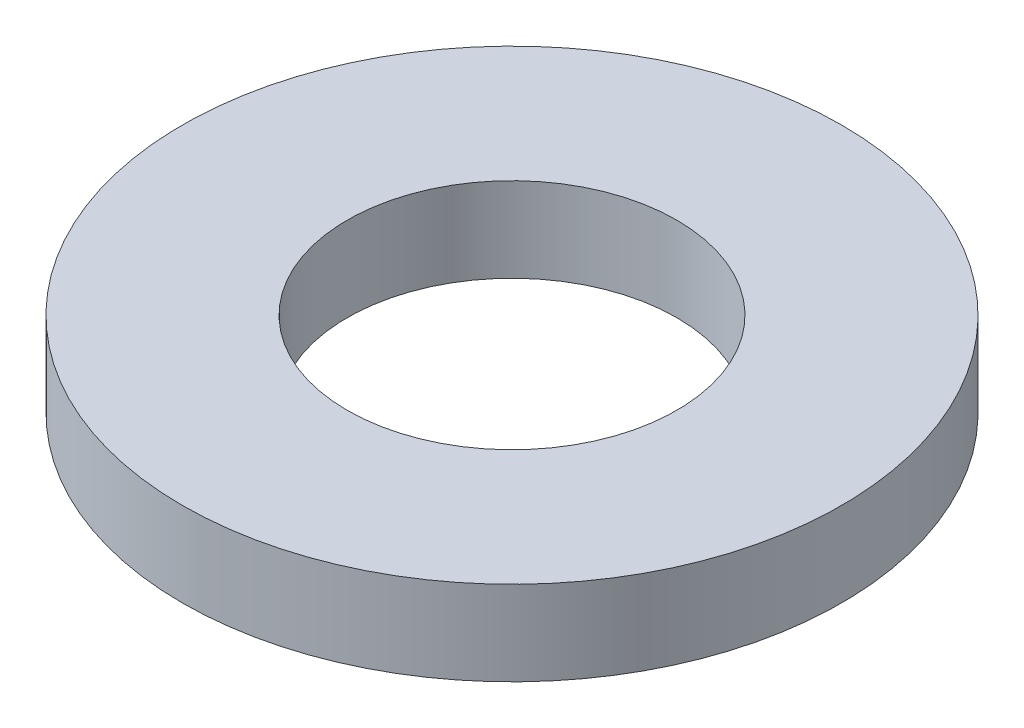
ISO-10303-21;
HEADER;
FILE_DESCRIPTION(('STEP AP214'),'2;1');
FILE_NAME('part.step','',(''),(''),'','','');
FILE_SCHEMA(('AUTOMOTIVE_DESIGN { 1 0 10303 214 1 1 1 1 }'));
ENDSEC;
DATA;
#1=APPLICATION_CONTEXT('core data for automotive mechanical design processes');
#2=APPLICATION_PROTOCOL_DEFINITION('international standard','automotive_design',2000,#1);
#3=PRODUCT_CONTEXT('',#1,'mechanical');
#4=PRODUCT('Part','Part','',(#3));
#5=PRODUCT_RELATED_PRODUCT_CATEGORY('part','',(#4));
#6=PRODUCT_DEFINITION_FORMATION('','',#4);
#7=PRODUCT_DEFINITION_CONTEXT('part definition',#1,'design');
#8=PRODUCT_DEFINITION('design','',#6,#7);
#9=PRODUCT_DEFINITION_SHAPE('','',#8);
#10=(LENGTH_UNIT() NAMED_UNIT(*) SI_UNIT(.MILLI.,.METRE.));
#11=(NAMED_UNIT(*) PLANE_ANGLE_UNIT() SI_UNIT($,.RADIAN.));
#12=(NAMED_UNIT(*) SI_UNIT($,.STERADIAN.) SOLID_ANGLE_UNIT());
#13=UNCERTAINTY_MEASURE_WITH_UNIT(LENGTH_MEASURE(1.E-05),#10,'distance_accuracy_value','');
#14=(GEOMETRIC_REPRESENTATION_CONTEXT(3) GLOBAL_UNCERTAINTY_ASSIGNED_CONTEXT((#13)) GLOBAL_UNIT_ASSIGNED_CONTEXT((#10,
#11,#12)) REPRESENTATION_CONTEXT('',''));
#15=CARTESIAN_POINT('',(0.,0.,0.));
#16=DIRECTION('',(0.,0.,1.));
#17=DIRECTION('',(1.,0.,0.));
#18=AXIS2_PLACEMENT_3D('',#15,#16,#17);
#19=CARTESIAN_POINT('',(-3.28626015289046E-11,1.01600000000968,-2.70894418008538E-11));
#20=DIRECTION('',(0.,-0.999999999999998,0.));
#21=DIRECTION('',(0.,0.,-1.00000000000013));
#22=AXIS2_PLACEMENT_3D('',#19,#20,#21);
#23=CYLINDRICAL_SURFACE('',#22,3.9624);
#24=CARTESIAN_POINT('',(-3.28626015289046E-11,1.01600000000968,-2.70894418008538E-11));
#25=DIRECTION('',(0.,0.999999999999998,0.));
#26=DIRECTION('',(0.,0.,1.00000000000013));
#27=AXIS2_PLACEMENT_3D('',#24,#25,#26);
#28=CIRCLE('',#27,3.9624);
#29=CARTESIAN_POINT('',(-3.29094524520457E-11,1.0160000000097,3.96239999997344));
#30=VERTEX_POINT('',#29);
#31=EDGE_CURVE('E10',#30,#30,#28,.T.);
#32=ORIENTED_EDGE('',*,*,#31,.F.);
#33=EDGE_LOOP('',(#32));
#34=FACE_BOUND('',#33,.T.);
#35=CARTESIAN_POINT('',(0.,0.,0.));
#36=DIRECTION('',(0.,0.999999999999998,0.));
#37=DIRECTION('',(0.,0.,1.00000000000013));
#38=AXIS2_PLACEMENT_3D('',#35,#36,#37);
#39=CIRCLE('',#38,3.9624);
#40=CARTESIAN_POINT('',(0.,0.,3.96240000000053));
#41=VERTEX_POINT('',#40);
#42=EDGE_CURVE('E37',#41,#41,#39,.T.);
#43=ORIENTED_EDGE('',*,*,#42,.T.);
#44=EDGE_LOOP('',(#43));
#45=FACE_BOUND('',#44,.T.);
#46=ADVANCED_FACE('F34',(#34,#45),#23,.T.);
#47=CARTESIAN_POINT('',(-3.28626015289046E-11,1.01600000000968,-2.70894418008538E-11));
#48=DIRECTION('',(0.,0.999999999999998,0.));
#49=DIRECTION('',(0.,0.,1.00000000000013));
#50=AXIS2_PLACEMENT_3D('',#47,#48,#49);
#51=PLANE('',#50);
#52=CARTESIAN_POINT('',(-3.28626015289046E-11,1.01600000000968,-2.70894418008538E-11));
#53=DIRECTION('',(0.,0.999999999999998,0.));
#54=DIRECTION('',(0.,0.,1.00000000000013));
#55=AXIS2_PLACEMENT_3D('',#52,#53,#54);
#56=CIRCLE('',#55,1.9812);
#57=CARTESIAN_POINT('',(-3.28860269904752E-11,1.01600000000969,1.98119999997317));
#58=VERTEX_POINT('',#57);
#59=EDGE_CURVE('E46',#58,#58,#56,.T.);
#60=ORIENTED_EDGE('',*,*,#59,.F.);
#61=EDGE_LOOP('',(#60));
#62=FACE_BOUND('',#61,.T.);
#63=ORIENTED_EDGE('',*,*,#31,.T.);
#64=EDGE_LOOP('',(#63));
#65=FACE_BOUND('',#64,.T.);
#66=ADVANCED_FACE('F61',(#62,#65),#51,.T.);
#67=CARTESIAN_POINT('',(0.,0.,0.));
#68=DIRECTION('',(0.,0.999999999999998,0.));
#69=DIRECTION('',(0.,0.,1.00000000000013));
#70=AXIS2_PLACEMENT_3D('',#67,#68,#69);
#71=PLANE('',#70);
#72=CARTESIAN_POINT('',(0.,0.,0.));
#73=DIRECTION('',(0.,0.999999999999998,0.));
#74=DIRECTION('',(0.,0.,1.00000000000013));
#75=AXIS2_PLACEMENT_3D('',#72,#73,#74);
#76=CIRCLE('',#75,1.9812);
#77=CARTESIAN_POINT('',(0.,0.,1.98120000000026));
#78=VERTEX_POINT('',#77);
#79=EDGE_CURVE('E44',#78,#78,#76,.T.);
#80=ORIENTED_EDGE('',*,*,#79,.T.);
#81=EDGE_LOOP('',(#80));
#82=FACE_BOUND('',#81,.T.);
#83=ORIENTED_EDGE('',*,*,#42,.F.);
#84=EDGE_LOOP('',(#83));
#85=FACE_BOUND('',#84,.T.);
#86=ADVANCED_FACE('F52',(#82,#85),#71,.F.);
#87=CARTESIAN_POINT('',(0.,0.,0.));
#88=DIRECTION('',(0.,0.999999999999998,0.));
#89=DIRECTION('',(0.,0.,1.00000000000013));
#90=AXIS2_PLACEMENT_3D('',#87,#88,#89);
#91=CYLINDRICAL_SURFACE('',#90,1.9812);
#92=ORIENTED_EDGE('',*,*,#79,.F.);
#93=EDGE_LOOP('',(#92));
#94=FACE_BOUND('',#93,.T.);
#95=ORIENTED_EDGE('',*,*,#59,.T.);
#96=EDGE_LOOP('',(#95));
#97=FACE_BOUND('',#96,.T.);
#98=ADVANCED_FACE('F55',(#94,#97),#91,.F.);
#99=CLOSED_SHELL('',(#46,#66,#86,#98));
#100=MANIFOLD_SOLID_BREP('B2',#99);
#101=ADVANCED_BREP_SHAPE_REPRESENTATION('',(#18,#100),#14);
#102=SHAPE_DEFINITION_REPRESENTATION(#9,#101);
ENDSEC;
END-ISO-10303-21;
